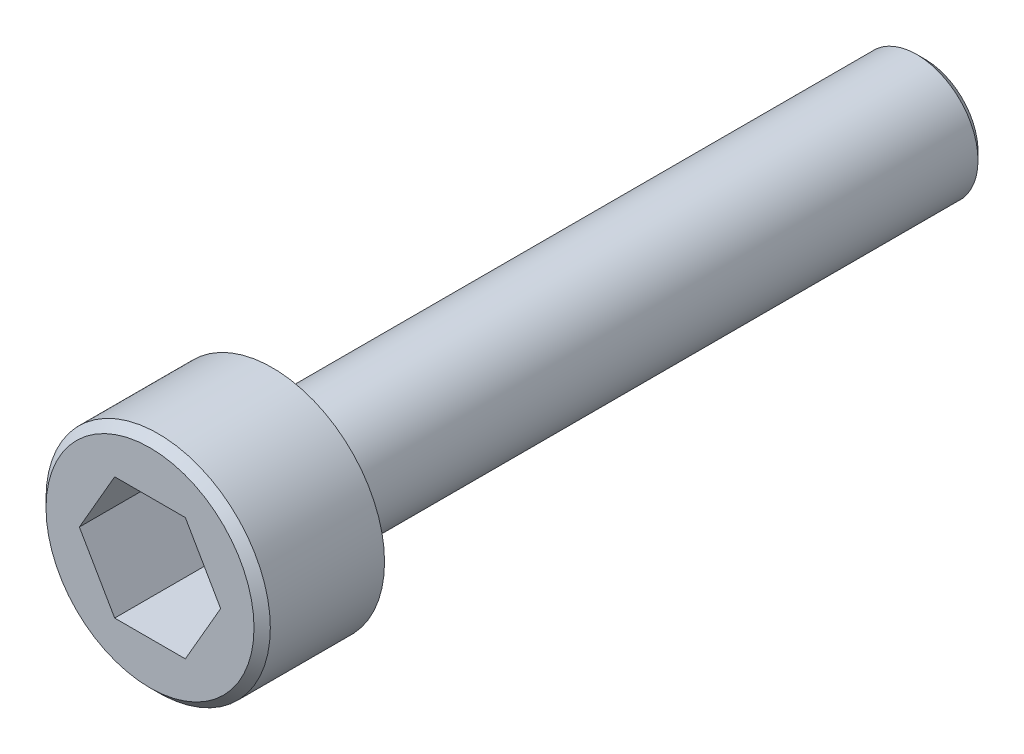
ISO-10303-21;
HEADER;
FILE_DESCRIPTION(('STEP AP214'),'2;1');
FILE_NAME('part.step','',(''),(''),'','','');
FILE_SCHEMA(('AUTOMOTIVE_DESIGN { 1 0 10303 214 1 1 1 1 }'));
ENDSEC;
DATA;
#1=APPLICATION_CONTEXT('core data for automotive mechanical design processes');
#2=APPLICATION_PROTOCOL_DEFINITION('international standard','automotive_design',2000,#1);
#3=PRODUCT_CONTEXT('',#1,'mechanical');
#4=PRODUCT('Part','Part','',(#3));
#5=PRODUCT_RELATED_PRODUCT_CATEGORY('part','',(#4));
#6=PRODUCT_DEFINITION_FORMATION('','',#4);
#7=PRODUCT_DEFINITION_CONTEXT('part definition',#1,'design');
#8=PRODUCT_DEFINITION('design','',#6,#7);
#9=PRODUCT_DEFINITION_SHAPE('','',#8);
#10=(LENGTH_UNIT() NAMED_UNIT(*) SI_UNIT(.MILLI.,.METRE.));
#11=(NAMED_UNIT(*) PLANE_ANGLE_UNIT() SI_UNIT($,.RADIAN.));
#12=(NAMED_UNIT(*) SI_UNIT($,.STERADIAN.) SOLID_ANGLE_UNIT());
#13=UNCERTAINTY_MEASURE_WITH_UNIT(LENGTH_MEASURE(1.E-05),#10,'distance_accuracy_value','');
#14=(GEOMETRIC_REPRESENTATION_CONTEXT(3) GLOBAL_UNCERTAINTY_ASSIGNED_CONTEXT((#13)) GLOBAL_UNIT_ASSIGNED_CONTEXT((#10,
#11,#12)) REPRESENTATION_CONTEXT('',''));
#15=CARTESIAN_POINT('',(0.,0.,0.));
#16=DIRECTION('',(0.,0.,1.));
#17=DIRECTION('',(1.,0.,0.));
#18=AXIS2_PLACEMENT_3D('',#15,#16,#17);
#19=CARTESIAN_POINT('',(-1.5,0.,-19.));
#20=DIRECTION('',(0.,0.,-1.));
#21=DIRECTION('',(-1.,0.,0.));
#22=AXIS2_PLACEMENT_3D('',#19,#20,#21);
#23=PLANE('',#22);
#24=CARTESIAN_POINT('',(0.,0.,-19.));
#25=DIRECTION('',(0.,0.,-1.));
#26=DIRECTION('',(-1.,0.,0.));
#27=AXIS2_PLACEMENT_3D('',#24,#25,#26);
#28=CIRCLE('',#27,1.3);
#29=CARTESIAN_POINT('',(-1.3,0.,-19.));
#30=VERTEX_POINT('',#29);
#31=EDGE_CURVE('E11',#30,#30,#28,.T.);
#32=ORIENTED_EDGE('',*,*,#31,.T.);
#33=EDGE_LOOP('',(#32));
#34=FACE_BOUND('',#33,.T.);
#35=ADVANCED_FACE('F34',(#34),#23,.T.);
#36=CARTESIAN_POINT('',(0.,0.,20.));
#37=DIRECTION('',(0.,0.,1.));
#38=DIRECTION('',(1.,0.,0.));
#39=AXIS2_PLACEMENT_3D('',#36,#37,#38);
#40=CYLINDRICAL_SURFACE('',#39,1.5);
#41=CARTESIAN_POINT('',(0.,0.,-18.8));
#42=DIRECTION('',(0.,0.,-1.));
#43=DIRECTION('',(-1.,0.,0.));
#44=AXIS2_PLACEMENT_3D('',#41,#42,#43);
#45=CIRCLE('',#44,1.5);
#46=CARTESIAN_POINT('',(-1.5,0.,-18.8));
#47=VERTEX_POINT('',#46);
#48=EDGE_CURVE('E42',#47,#47,#45,.F.);
#49=ORIENTED_EDGE('',*,*,#48,.T.);
#50=EDGE_LOOP('',(#49));
#51=FACE_BOUND('',#50,.T.);
#52=CARTESIAN_POINT('',(0.,0.,-3.));
#53=DIRECTION('',(0.,0.,1.));
#54=DIRECTION('',(1.,0.,0.));
#55=AXIS2_PLACEMENT_3D('',#52,#53,#54);
#56=CIRCLE('',#55,1.5);
#57=CARTESIAN_POINT('',(1.5,0.,-3.));
#58=VERTEX_POINT('',#57);
#59=EDGE_CURVE('E208',#58,#58,#56,.T.);
#60=ORIENTED_EDGE('',*,*,#59,.F.);
#61=EDGE_LOOP('',(#60));
#62=FACE_BOUND('',#61,.T.);
#63=ADVANCED_FACE('F188',(#51,#62),#40,.T.);
#64=CARTESIAN_POINT('',(-2.75,0.,-3.));
#65=DIRECTION('',(0.,0.,-1.));
#66=DIRECTION('',(-1.,0.,0.));
#67=AXIS2_PLACEMENT_3D('',#64,#65,#66);
#68=PLANE('',#67);
#69=ORIENTED_EDGE('',*,*,#59,.T.);
#70=EDGE_LOOP('',(#69));
#71=FACE_BOUND('',#70,.T.);
#72=CARTESIAN_POINT('',(0.,0.,-3.));
#73=DIRECTION('',(0.,0.,1.));
#74=DIRECTION('',(1.,0.,0.));
#75=AXIS2_PLACEMENT_3D('',#72,#73,#74);
#76=CIRCLE('',#75,2.75);
#77=CARTESIAN_POINT('',(2.75,0.,-3.));
#78=VERTEX_POINT('',#77);
#79=EDGE_CURVE('E212',#78,#78,#76,.T.);
#80=ORIENTED_EDGE('',*,*,#79,.F.);
#81=EDGE_LOOP('',(#80));
#82=FACE_BOUND('',#81,.T.);
#83=ADVANCED_FACE('F184',(#71,#82),#68,.T.);
#84=CARTESIAN_POINT('',(0.,0.,20.));
#85=DIRECTION('',(0.,0.,1.));
#86=DIRECTION('',(1.,0.,0.));
#87=AXIS2_PLACEMENT_3D('',#84,#85,#86);
#88=CYLINDRICAL_SURFACE('',#87,2.75);
#89=CARTESIAN_POINT('',(0.,0.,-0.200000000000002));
#90=DIRECTION('',(0.,0.,1.));
#91=DIRECTION('',(1.,0.,0.));
#92=AXIS2_PLACEMENT_3D('',#89,#90,#91);
#93=CIRCLE('',#92,2.75);
#94=CARTESIAN_POINT('',(2.75,0.,-0.200000000000002));
#95=VERTEX_POINT('',#94);
#96=EDGE_CURVE('E204',#95,#95,#93,.F.);
#97=ORIENTED_EDGE('',*,*,#96,.T.);
#98=EDGE_LOOP('',(#97));
#99=FACE_BOUND('',#98,.T.);
#100=ORIENTED_EDGE('',*,*,#79,.T.);
#101=EDGE_LOOP('',(#100));
#102=FACE_BOUND('',#101,.T.);
#103=ADVANCED_FACE('F180',(#99,#102),#88,.T.);
#104=CARTESIAN_POINT('',(0.,0.,0.));
#105=DIRECTION('',(0.,0.,1.));
#106=DIRECTION('',(1.,0.,0.));
#107=AXIS2_PLACEMENT_3D('',#104,#105,#106);
#108=PLANE('',#107);
#109=CARTESIAN_POINT('',(0.,0.,0.));
#110=DIRECTION('',(0.,0.,1.));
#111=DIRECTION('',(1.,0.,0.));
#112=AXIS2_PLACEMENT_3D('',#109,#110,#111);
#113=CIRCLE('',#112,2.55);
#114=CARTESIAN_POINT('',(2.55,0.,0.));
#115=VERTEX_POINT('',#114);
#116=EDGE_CURVE('E207',#115,#115,#113,.T.);
#117=ORIENTED_EDGE('',*,*,#116,.T.);
#118=EDGE_LOOP('',(#117));
#119=FACE_BOUND('',#118,.T.);
#120=DIRECTION('',(0.499999999999999,-0.866025403784439,0.));
#121=VECTOR('',#120,1.);
#122=CARTESIAN_POINT('',(-1.73205080756888,0.,0.));
#123=LINE('',#122,#121);
#124=CARTESIAN_POINT('',(-1.73205080756888,0.,0.));
#125=VERTEX_POINT('',#124);
#126=CARTESIAN_POINT('',(-0.866025403784438,-1.5,0.));
#127=VERTEX_POINT('',#126);
#128=EDGE_CURVE('E224',#125,#127,#123,.T.);
#129=ORIENTED_EDGE('',*,*,#128,.F.);
#130=DIRECTION('',(0.5,0.866025403784438,0.));
#131=VECTOR('',#130,1.);
#132=CARTESIAN_POINT('',(-1.73205080756888,0.,0.));
#133=LINE('',#132,#131);
#134=CARTESIAN_POINT('',(-0.866025403784436,1.5,0.));
#135=VERTEX_POINT('',#134);
#136=EDGE_CURVE('E104',#125,#135,#133,.T.);
#137=ORIENTED_EDGE('',*,*,#136,.T.);
#138=DIRECTION('',(1.,0.,0.));
#139=VECTOR('',#138,1.);
#140=CARTESIAN_POINT('',(-0.866025403784436,1.5,0.));
#141=LINE('',#140,#139);
#142=CARTESIAN_POINT('',(0.866025403784436,1.5,0.));
#143=VERTEX_POINT('',#142);
#144=EDGE_CURVE('E244',#135,#143,#141,.T.);
#145=ORIENTED_EDGE('',*,*,#144,.T.);
#146=DIRECTION('',(-0.5,0.866025403784439,0.));
#147=VECTOR('',#146,1.);
#148=CARTESIAN_POINT('',(1.73205080756888,0.,0.));
#149=LINE('',#148,#147);
#150=CARTESIAN_POINT('',(1.73205080756888,0.,0.));
#151=VERTEX_POINT('',#150);
#152=EDGE_CURVE('E241',#151,#143,#149,.T.);
#153=ORIENTED_EDGE('',*,*,#152,.F.);
#154=DIRECTION('',(-0.500000000000001,-0.866025403784438,0.));
#155=VECTOR('',#154,1.);
#156=CARTESIAN_POINT('',(1.73205080756888,0.,0.));
#157=LINE('',#156,#155);
#158=CARTESIAN_POINT('',(0.866025403784437,-1.5,0.));
#159=VERTEX_POINT('',#158);
#160=EDGE_CURVE('E238',#151,#159,#157,.T.);
#161=ORIENTED_EDGE('',*,*,#160,.T.);
#162=DIRECTION('',(1.,0.,0.));
#163=VECTOR('',#162,1.);
#164=CARTESIAN_POINT('',(-0.866025403784438,-1.5,0.));
#165=LINE('',#164,#163);
#166=EDGE_CURVE('E225',#127,#159,#165,.T.);
#167=ORIENTED_EDGE('',*,*,#166,.F.);
#168=EDGE_LOOP('',(#129,#137,#145,#153,#161,#167));
#169=FACE_BOUND('',#168,.T.);
#170=ADVANCED_FACE('F176',(#119,#169),#108,.T.);
#171=CARTESIAN_POINT('',(0.,0.,0.));
#172=DIRECTION('',(0.,0.,-1.));
#173=DIRECTION('',(-1.,0.,0.));
#174=AXIS2_PLACEMENT_3D('',#171,#172,#173);
#175=CONICAL_SURFACE('',#174,2.55,0.785398163397451);
#176=ORIENTED_EDGE('',*,*,#96,.F.);
#177=EDGE_LOOP('',(#176));
#178=FACE_BOUND('',#177,.T.);
#179=ORIENTED_EDGE('',*,*,#116,.F.);
#180=EDGE_LOOP('',(#179));
#181=FACE_BOUND('',#180,.T.);
#182=ADVANCED_FACE('F179',(#178,#181),#175,.T.);
#183=CARTESIAN_POINT('',(0.,0.,-18.8));
#184=DIRECTION('',(0.,0.,1.));
#185=DIRECTION('',(1.,0.,0.));
#186=AXIS2_PLACEMENT_3D('',#183,#184,#185);
#187=CONICAL_SURFACE('',#186,1.5,0.785398163397443);
#188=ORIENTED_EDGE('',*,*,#31,.F.);
#189=EDGE_LOOP('',(#188));
#190=FACE_BOUND('',#189,.T.);
#191=ORIENTED_EDGE('',*,*,#48,.F.);
#192=EDGE_LOOP('',(#191));
#193=FACE_BOUND('',#192,.T.);
#194=ADVANCED_FACE('F36',(#190,#193),#187,.T.);
#195=CARTESIAN_POINT('',(-1.73205080756888,0.,-19.001));
#196=DIRECTION('',(0.866025403784438,-0.5,0.));
#197=DIRECTION('',(0.5,0.866025403784438,0.));
#198=AXIS2_PLACEMENT_3D('',#195,#196,#197);
#199=PLANE('',#198);
#200=DIRECTION('',(0.,0.,1.));
#201=VECTOR('',#200,1.);
#202=CARTESIAN_POINT('',(-0.866025403784436,1.5,-19.001));
#203=LINE('',#202,#201);
#204=CARTESIAN_POINT('',(-0.866025403784436,1.5,-2.4));
#205=VERTEX_POINT('',#204);
#206=EDGE_CURVE('E106',#205,#135,#203,.T.);
#207=ORIENTED_EDGE('',*,*,#206,.T.);
#208=ORIENTED_EDGE('',*,*,#136,.F.);
#209=DIRECTION('',(0.,0.,1.));
#210=VECTOR('',#209,1.);
#211=CARTESIAN_POINT('',(-1.73205080756888,0.,-19.001));
#212=LINE('',#211,#210);
#213=CARTESIAN_POINT('',(-1.73205080756888,0.,-2.4));
#214=VERTEX_POINT('',#213);
#215=EDGE_CURVE('E91',#214,#125,#212,.T.);
#216=ORIENTED_EDGE('',*,*,#215,.F.);
#217=CARTESIAN_POINT('',(-0.865909933730598,1.5002,-2.39993332666711));
#218=CARTESIAN_POINT('',(-0.903968454193443,1.43428070889745,-2.42191714344639));
#219=CARTESIAN_POINT('',(-0.942355490953069,1.36779241087777,-2.44191111053374));
#220=CARTESIAN_POINT('',(-1.01979436916421,1.23366433933493,-2.47681189903106));
#221=CARTESIAN_POINT('',(-1.05884758728358,1.16602218135312,-2.4917063718924));
#222=CARTESIAN_POINT('',(-1.13646999803241,1.03157622213016,-2.51489331890532));
#223=CARTESIAN_POINT('',(-1.17502724286932,0.964793115072755,-2.52334008850375));
#224=CARTESIAN_POINT('',(-1.25232329150576,0.830912431610123,-2.53342642270371));
#225=CARTESIAN_POINT('',(-1.29106181408333,0.763815342295625,-2.53507433685767));
#226=CARTESIAN_POINT('',(-1.363455807133,0.638425268170808,-2.53165837716246));
#227=CARTESIAN_POINT('',(-1.39712207785428,0.580113576780184,-2.52743324099159));
#228=CARTESIAN_POINT('',(-1.46423526865157,0.46387012046122,-2.51403822478289));
#229=CARTESIAN_POINT('',(-1.49768195634505,0.405938758031216,-2.50486376259972));
#230=CARTESIAN_POINT('',(-1.56493368410116,0.289455348660849,-2.48192681626057));
#231=CARTESIAN_POINT('',(-1.59873020609216,0.230918055453309,-2.46806703805412));
#232=CARTESIAN_POINT('',(-1.6658189879754,0.114716876613641,-2.43661021597891));
#233=CARTESIAN_POINT('',(-1.69911210834199,0.0570515005961899,-2.41902057032595));
#234=CARTESIAN_POINT('',(-1.73216627762271,-0.000199999999999791,-2.39993332666711));
#235=B_SPLINE_CURVE_WITH_KNOTS('',3,(#217,#218,#219,#220,#221,#222,#223,#224,#225,#226,#227,
#228,#229,#230,#231,#232,#233,#234),.UNSPECIFIED.,.F.,.F.,(4,2,2,2,2,2,2,2,4),(0.,
0.237777822177382,0.476127422841917,0.708577067230587,0.940741159251576,1.1429435283589,
1.34533342091875,1.55221450553907,1.75868901573748),.UNSPECIFIED.);
#236=EDGE_CURVE('E98',#205,#214,#235,.T.);
#237=ORIENTED_EDGE('',*,*,#236,.F.);
#238=EDGE_LOOP('',(#207,#208,#216,#237));
#239=FACE_BOUND('',#238,.T.);
#240=ADVANCED_FACE('F101',(#239),#199,.T.);
#241=CARTESIAN_POINT('',(-0.866025403784436,1.5,-19.001));
#242=DIRECTION('',(0.,-1.,0.));
#243=DIRECTION('',(0.,0.,-1.));
#244=AXIS2_PLACEMENT_3D('',#241,#242,#243);
#245=PLANE('',#244);
#246=DIRECTION('',(0.,0.,1.));
#247=VECTOR('',#246,1.);
#248=CARTESIAN_POINT('',(0.866025403784436,1.5,-19.001));
#249=LINE('',#248,#247);
#250=CARTESIAN_POINT('',(0.866025403784436,1.5,-2.4));
#251=VERTEX_POINT('',#250);
#252=EDGE_CURVE('E233',#251,#143,#249,.T.);
#253=ORIENTED_EDGE('',*,*,#252,.T.);
#254=ORIENTED_EDGE('',*,*,#144,.F.);
#255=ORIENTED_EDGE('',*,*,#206,.F.);
#256=CARTESIAN_POINT('',(-2.25829748809578,1.5,-1.83476226036428));
#257=CARTESIAN_POINT('',(-2.19329373978807,1.5,-1.86601519216719));
#258=CARTESIAN_POINT('',(-2.128133312472,1.5,-1.89694788984993));
#259=CARTESIAN_POINT('',(-1.99741509731926,1.5,-1.95799129175253));
#260=CARTESIAN_POINT('',(-1.93185724176724,1.5,-1.98810185079199));
#261=CARTESIAN_POINT('',(-1.79988874513808,1.5,-2.04748572809429));
#262=CARTESIAN_POINT('',(-1.73347534797759,1.5,-2.07675294876988));
#263=CARTESIAN_POINT('',(-1.60009663184604,1.5,-2.13399348153228));
#264=CARTESIAN_POINT('',(-1.53313134145763,1.5,-2.16196686013744));
#265=CARTESIAN_POINT('',(-1.39671194439803,1.5,-2.21701546037724));
#266=CARTESIAN_POINT('',(-1.32723952366604,1.5,-2.24404589795094));
#267=CARTESIAN_POINT('',(-1.18747230288705,1.5,-2.29588215834872));
#268=CARTESIAN_POINT('',(-1.11717740111601,1.5,-2.32068770263997));
#269=CARTESIAN_POINT('',(-0.905166704401074,1.5,-2.39073382927791));
#270=CARTESIAN_POINT('',(-0.761941643732071,1.5,-2.4317657243214));
#271=CARTESIAN_POINT('',(-0.544391782620257,1.5,-2.47950620462369));
#272=CARTESIAN_POINT('',(-0.471586349738135,1.5,-2.49310360316395));
#273=CARTESIAN_POINT('',(-0.325142130511555,1.5,-2.51480485629881));
#274=CARTESIAN_POINT('',(-0.251503405528381,1.5,-2.52290911275084));
#275=CARTESIAN_POINT('',(-0.104694150763983,1.5,-2.53287418939744));
#276=CARTESIAN_POINT('',(-0.0315288308890994,1.5,-2.53480979779495));
#277=CARTESIAN_POINT('',(0.114700561049707,1.5,-2.53247388232289));
#278=CARTESIAN_POINT('',(0.187764626951758,1.5,-2.52820199598046));
#279=CARTESIAN_POINT('',(0.367239252204652,1.5,-2.51046042595599));
#280=CARTESIAN_POINT('',(0.473317955749639,1.5,-2.49363148098316));
#281=CARTESIAN_POINT('',(0.683435623347444,1.5,-2.45002097312359));
#282=CARTESIAN_POINT('',(0.787472001216273,1.5,-2.42322755294101));
#283=CARTESIAN_POINT('',(0.94308098733902,1.5,-2.37736239718424));
#284=CARTESIAN_POINT('',(0.995456162128427,1.5,-2.36091222394733));
#285=CARTESIAN_POINT('',(1.09966136197824,1.5,-2.32646559475645));
#286=CARTESIAN_POINT('',(1.15149170317922,1.5,-2.30847009821455));
#287=CARTESIAN_POINT('',(1.25467578293171,1.5,-2.27119644603533));
#288=CARTESIAN_POINT('',(1.30602960082239,1.5,-2.25191850844964));
#289=CARTESIAN_POINT('',(1.40833061218766,1.5,-2.21229102105092));
#290=CARTESIAN_POINT('',(1.45927773605958,1.5,-2.19194129215231));
#291=CARTESIAN_POINT('',(1.59055522154703,1.5,-2.13817109724277));
#292=CARTESIAN_POINT('',(1.67061014066948,1.5,-2.10407883269812));
#293=CARTESIAN_POINT('',(1.82998280172007,1.5,-2.03420800028333));
#294=CARTESIAN_POINT('',(1.90930048451934,1.5,-1.99842929852874));
#295=CARTESIAN_POINT('',(2.14639693381873,1.5,-1.88916412533198));
#296=CARTESIAN_POINT('',(2.30329043971988,1.5,-1.81376068715346));
#297=CARTESIAN_POINT('',(2.61572428743805,1.5,-1.65974435711267));
#298=CARTESIAN_POINT('',(2.77126264489306,1.5,-1.581127488845));
#299=CARTESIAN_POINT('',(3.08126266164183,1.5,-1.42185383584809));
#300=CARTESIAN_POINT('',(3.23572446316291,1.5,-1.34119732735825));
#301=CARTESIAN_POINT('',(3.52907913435708,1.5,-1.18631207108897));
#302=CARTESIAN_POINT('',(3.66803997220469,1.5,-1.1122115998725));
#303=CARTESIAN_POINT('',(3.94551399229581,1.5,-0.963164818284441));
#304=CARTESIAN_POINT('',(4.08402715661448,1.5,-0.888218474570878));
#305=CARTESIAN_POINT('',(4.36034399180415,1.5,-0.737891818107906));
#306=CARTESIAN_POINT('',(4.49814857040257,1.5,-0.662513171610507));
#307=CARTESIAN_POINT('',(4.77347897270567,1.5,-0.511266152172993));
#308=CARTESIAN_POINT('',(4.9110048112979,1.5,-0.43539780634461));
#309=CARTESIAN_POINT('',(5.04843083843807,1.5,-0.35935018291089));
#310=B_SPLINE_CURVE_WITH_KNOTS('',3,(#256,#257,#258,#259,#260,#261,#262,#263,#264,#265,#266,
#267,#268,#269,#270,#271,#272,#273,#274,#275,#276,#277,#278,#279,#280,#281,#282,#283,#284,#285,
#286,#287,#288,#289,#290,#291,#292,#293,#294,#295,#296,#297,#298,#299,#300,#301,#302,#303,#304,
#305,#306,#307,#308,#309),.UNSPECIFIED.,.F.,.F.,(4,2,2,2,2,2,2,2,2,2,2,2,2,2,2,2,2,2,2,2,2,2,2,
2,2,2,4),(0.,0.216382219525618,0.432802405770669,0.65051933644601,0.868225061501739,
1.09182159712903,1.31544608569343,1.76144887147315,1.9834748614657,2.20548460712569,
2.42479227767853,2.64411275473036,2.96566825751222,3.28760762820845,3.45228256222909,
3.61685598713247,3.78140150101924,3.94597459657939,4.20698199748248,4.46801015449814,
4.99015975049455,5.51297628653598,6.03572239000219,6.50816903094607,6.98063435993274,
7.45185338987376,7.92304655125478),.UNSPECIFIED.);
#311=EDGE_CURVE('E112',#251,#205,#310,.F.);
#312=ORIENTED_EDGE('',*,*,#311,.F.);
#313=EDGE_LOOP('',(#253,#254,#255,#312));
#314=FACE_BOUND('',#313,.T.);
#315=ADVANCED_FACE('F161',(#314),#245,.T.);
#316=CARTESIAN_POINT('',(1.73205080756888,0.,-19.001));
#317=DIRECTION('',(0.866025403784439,0.5,0.));
#318=DIRECTION('',(-0.5,0.866025403784439,0.));
#319=AXIS2_PLACEMENT_3D('',#316,#317,#318);
#320=PLANE('',#319);
#321=CARTESIAN_POINT('',(0.865909933730598,1.5002,-2.39993332666712));
#322=CARTESIAN_POINT('',(0.903968454193444,1.43428070889745,-2.42191714344639));
#323=CARTESIAN_POINT('',(0.94235549095307,1.36779241087776,-2.44191111053374));
#324=CARTESIAN_POINT('',(1.01979436916421,1.23366433933493,-2.47681189903106));
#325=CARTESIAN_POINT('',(1.05884758728358,1.16602218135311,-2.4917063718924));
#326=CARTESIAN_POINT('',(1.13646999803241,1.03157622213015,-2.51489331890532));
#327=CARTESIAN_POINT('',(1.17502724286933,0.964793115072749,-2.52334008850375));
#328=CARTESIAN_POINT('',(1.25232329150577,0.830912431610116,-2.53342642270371));
#329=CARTESIAN_POINT('',(1.29106181408333,0.763815342295617,-2.53507433685768));
#330=CARTESIAN_POINT('',(1.363455807133,0.6384252681708,-2.53165837716246));
#331=CARTESIAN_POINT('',(1.39712207785428,0.580113576780176,-2.52743324099159));
#332=CARTESIAN_POINT('',(1.46423526865157,0.463870120461214,-2.5140382247829));
#333=CARTESIAN_POINT('',(1.49768195634505,0.405938758031211,-2.50486376259972));
#334=CARTESIAN_POINT('',(1.56493368410116,0.289455348660845,-2.48192681626057));
#335=CARTESIAN_POINT('',(1.59873020609216,0.230918055453305,-2.46806703805412));
#336=CARTESIAN_POINT('',(1.6658189879754,0.114716876613638,-2.43661021597891));
#337=CARTESIAN_POINT('',(1.69911210834199,0.0570515005961871,-2.41902057032595));
#338=CARTESIAN_POINT('',(1.73216627762271,-0.00020000000000196,-2.39993332666712));
#339=B_SPLINE_CURVE_WITH_KNOTS('',3,(#321,#322,#323,#324,#325,#326,#327,#328,#329,#330,#331,
#332,#333,#334,#335,#336,#337,#338),.UNSPECIFIED.,.F.,.F.,(4,2,2,2,2,2,2,2,4),(0.,
0.237777822177385,0.476127422841921,0.708577067230593,0.940741159251585,1.14294352835891,
1.34533342091876,1.55221450553907,1.75868901573748),.UNSPECIFIED.);
#340=CARTESIAN_POINT('',(1.73205080756888,0.,-2.40000000000001));
#341=VERTEX_POINT('',#340);
#342=EDGE_CURVE('E114',#251,#341,#339,.T.);
#343=ORIENTED_EDGE('',*,*,#342,.T.);
#344=DIRECTION('',(0.,0.,1.));
#345=VECTOR('',#344,1.);
#346=CARTESIAN_POINT('',(1.73205080756888,0.,-19.001));
#347=LINE('',#346,#345);
#348=EDGE_CURVE('E231',#341,#151,#347,.T.);
#349=ORIENTED_EDGE('',*,*,#348,.T.);
#350=ORIENTED_EDGE('',*,*,#152,.T.);
#351=ORIENTED_EDGE('',*,*,#252,.F.);
#352=EDGE_LOOP('',(#343,#349,#350,#351));
#353=FACE_BOUND('',#352,.T.);
#354=ADVANCED_FACE('F158',(#353),#320,.F.);
#355=CARTESIAN_POINT('',(-1.73205080756888,0.,-19.001));
#356=DIRECTION('',(-0.866025403784439,-0.499999999999999,0.));
#357=DIRECTION('',(0.499999999999999,-0.866025403784439,0.));
#358=AXIS2_PLACEMENT_3D('',#355,#356,#357);
#359=PLANE('',#358);
#360=CARTESIAN_POINT('',(-0.865909933730601,-1.5002,-2.39993332666711));
#361=CARTESIAN_POINT('',(-0.903968454193446,-1.43428070889745,-2.42191714344639));
#362=CARTESIAN_POINT('',(-0.942355490953072,-1.36779241087777,-2.44191111053374));
#363=CARTESIAN_POINT('',(-1.01979436916421,-1.23366433933493,-2.47681189903106));
#364=CARTESIAN_POINT('',(-1.05884758728358,-1.16602218135311,-2.4917063718924));
#365=CARTESIAN_POINT('',(-1.13646999803241,-1.03157622213016,-2.51489331890532));
#366=CARTESIAN_POINT('',(-1.17502724286932,-0.964793115072754,-2.52334008850375));
#367=CARTESIAN_POINT('',(-1.25232329150577,-0.830912431610122,-2.53342642270371));
#368=CARTESIAN_POINT('',(-1.29106181408333,-0.763815342295624,-2.53507433685767));
#369=CARTESIAN_POINT('',(-1.363455807133,-0.638425268170807,-2.53165837716246));
#370=CARTESIAN_POINT('',(-1.39712207785428,-0.580113576780183,-2.52743324099159));
#371=CARTESIAN_POINT('',(-1.46423526865157,-0.463870120461219,-2.51403822478289));
#372=CARTESIAN_POINT('',(-1.49768195634505,-0.405938758031216,-2.50486376259972));
#373=CARTESIAN_POINT('',(-1.56493368410116,-0.289455348660849,-2.48192681626057));
#374=CARTESIAN_POINT('',(-1.59873020609216,-0.230918055453309,-2.46806703805412));
#375=CARTESIAN_POINT('',(-1.6658189879754,-0.114716876613641,-2.43661021597891));
#376=CARTESIAN_POINT('',(-1.69911210834199,-0.0570515005961899,-2.41902057032595));
#377=CARTESIAN_POINT('',(-1.73216627762271,0.0001999999999998,-2.39993332666711));
#378=B_SPLINE_CURVE_WITH_KNOTS('',3,(#360,#361,#362,#363,#364,#365,#366,#367,#368,#369,#370,
#371,#372,#373,#374,#375,#376,#377),.UNSPECIFIED.,.F.,.F.,(4,2,2,2,2,2,2,2,4),(0.,
0.237777822177382,0.476127422841917,0.708577067230587,0.940741159251577,1.1429435283589,
1.34533342091875,1.55221450553907,1.75868901573748),.UNSPECIFIED.);
#379=CARTESIAN_POINT('',(-0.866025403784438,-1.5,-2.4));
#380=VERTEX_POINT('',#379);
#381=EDGE_CURVE('E88',#380,#214,#378,.T.);
#382=ORIENTED_EDGE('',*,*,#381,.T.);
#383=ORIENTED_EDGE('',*,*,#215,.T.);
#384=ORIENTED_EDGE('',*,*,#128,.T.);
#385=DIRECTION('',(0.,0.,1.));
#386=VECTOR('',#385,1.);
#387=CARTESIAN_POINT('',(-0.866025403784438,-1.5,-19.001));
#388=LINE('',#387,#386);
#389=EDGE_CURVE('E94',#380,#127,#388,.T.);
#390=ORIENTED_EDGE('',*,*,#389,.F.);
#391=EDGE_LOOP('',(#382,#383,#384,#390));
#392=FACE_BOUND('',#391,.T.);
#393=ADVANCED_FACE('F90',(#392),#359,.F.);
#394=CARTESIAN_POINT('',(1.73205080756888,0.,-19.001));
#395=DIRECTION('',(-0.866025403784438,0.500000000000001,0.));
#396=DIRECTION('',(-0.500000000000001,-0.866025403784438,0.));
#397=AXIS2_PLACEMENT_3D('',#394,#395,#396);
#398=PLANE('',#397);
#399=DIRECTION('',(0.,0.,1.));
#400=VECTOR('',#399,1.);
#401=CARTESIAN_POINT('',(0.866025403784437,-1.5,-19.001));
#402=LINE('',#401,#400);
#403=CARTESIAN_POINT('',(0.866025403784429,-1.50000000000001,-2.4));
#404=VERTEX_POINT('',#403);
#405=EDGE_CURVE('E229',#404,#159,#402,.T.);
#406=ORIENTED_EDGE('',*,*,#405,.T.);
#407=ORIENTED_EDGE('',*,*,#160,.F.);
#408=ORIENTED_EDGE('',*,*,#348,.F.);
#409=CARTESIAN_POINT('',(0.865909933730599,-1.5002,-2.39993332666712));
#410=CARTESIAN_POINT('',(0.903968454193444,-1.43428070889745,-2.42191714344639));
#411=CARTESIAN_POINT('',(0.942355490953071,-1.36779241087776,-2.44191111053374));
#412=CARTESIAN_POINT('',(1.01979436916421,-1.23366433933493,-2.47681189903106));
#413=CARTESIAN_POINT('',(1.05884758728358,-1.16602218135311,-2.4917063718924));
#414=CARTESIAN_POINT('',(1.13646999803241,-1.03157622213015,-2.51489331890532));
#415=CARTESIAN_POINT('',(1.17502724286933,-0.964793115072749,-2.52334008850375));
#416=CARTESIAN_POINT('',(1.25232329150577,-0.830912431610115,-2.53342642270371));
#417=CARTESIAN_POINT('',(1.29106181408333,-0.763815342295617,-2.53507433685767));
#418=CARTESIAN_POINT('',(1.36345580713301,-0.638425268170801,-2.53165837716246));
#419=CARTESIAN_POINT('',(1.39712207785428,-0.580113576780177,-2.52743324099159));
#420=CARTESIAN_POINT('',(1.46423526865157,-0.463870120461215,-2.51403822478289));
#421=CARTESIAN_POINT('',(1.49768195634505,-0.405938758031212,-2.50486376259972));
#422=CARTESIAN_POINT('',(1.56493368410116,-0.289455348660847,-2.48192681626057));
#423=CARTESIAN_POINT('',(1.59873020609216,-0.230918055453308,-2.46806703805412));
#424=CARTESIAN_POINT('',(1.6658189879754,-0.114716876613641,-2.43661021597891));
#425=CARTESIAN_POINT('',(1.69911210834199,-0.057051500596191,-2.41902057032595));
#426=CARTESIAN_POINT('',(1.73216627762271,0.000199999999997863,-2.39993332666712));
#427=B_SPLINE_CURVE_WITH_KNOTS('',3,(#409,#410,#411,#412,#413,#414,#415,#416,#417,#418,#419,
#420,#421,#422,#423,#424,#425,#426),.UNSPECIFIED.,.F.,.F.,(4,2,2,2,2,2,2,2,4),(0.,
0.237777822177385,0.476127422841921,0.708577067230594,0.940741159251585,1.14294352835891,
1.34533342091876,1.55221450553907,1.75868901573748),.UNSPECIFIED.);
#428=EDGE_CURVE('E49',#404,#341,#427,.T.);
#429=ORIENTED_EDGE('',*,*,#428,.F.);
#430=EDGE_LOOP('',(#406,#407,#408,#429));
#431=FACE_BOUND('',#430,.T.);
#432=ADVANCED_FACE('F163',(#431),#398,.T.);
#433=CARTESIAN_POINT('',(-0.866025403784438,-1.5,-19.001));
#434=DIRECTION('',(0.,-1.,0.));
#435=DIRECTION('',(0.,0.,-1.));
#436=AXIS2_PLACEMENT_3D('',#433,#434,#435);
#437=PLANE('',#436);
#438=CARTESIAN_POINT('',(-2.25829748809579,-1.5,-1.83476226036428));
#439=CARTESIAN_POINT('',(-2.19329373978807,-1.5,-1.86601519216719));
#440=CARTESIAN_POINT('',(-2.128133312472,-1.5,-1.89694788984992));
#441=CARTESIAN_POINT('',(-1.99741509731926,-1.5,-1.95799129175253));
#442=CARTESIAN_POINT('',(-1.93185724176724,-1.5,-1.98810185079199));
#443=CARTESIAN_POINT('',(-1.79988874513808,-1.5,-2.04748572809429));
#444=CARTESIAN_POINT('',(-1.73347534797759,-1.5,-2.07675294876987));
#445=CARTESIAN_POINT('',(-1.60009663184604,-1.5,-2.13399348153228));
#446=CARTESIAN_POINT('',(-1.53313134145764,-1.5,-2.16196686013744));
#447=CARTESIAN_POINT('',(-1.39671194439803,-1.5,-2.21701546037724));
#448=CARTESIAN_POINT('',(-1.32723952366604,-1.5,-2.24404589795094));
#449=CARTESIAN_POINT('',(-1.18747230288705,-1.5,-2.29588215834872));
#450=CARTESIAN_POINT('',(-1.11717740111601,-1.5,-2.32068770263997));
#451=CARTESIAN_POINT('',(-0.905166704401076,-1.5,-2.39073382927791));
#452=CARTESIAN_POINT('',(-0.761941643732073,-1.5,-2.4317657243214));
#453=CARTESIAN_POINT('',(-0.544391782620259,-1.5,-2.47950620462369));
#454=CARTESIAN_POINT('',(-0.471586349738137,-1.5,-2.49310360316395));
#455=CARTESIAN_POINT('',(-0.325142130511556,-1.5,-2.51480485629881));
#456=CARTESIAN_POINT('',(-0.251503405528383,-1.5,-2.52290911275084));
#457=CARTESIAN_POINT('',(-0.104694150763985,-1.5,-2.53287418939744));
#458=CARTESIAN_POINT('',(-0.0315288308891013,-1.5,-2.53480979779495));
#459=CARTESIAN_POINT('',(0.114700561049705,-1.5,-2.53247388232289));
#460=CARTESIAN_POINT('',(0.187764626951756,-1.5,-2.52820199598046));
#461=CARTESIAN_POINT('',(0.36723925220465,-1.5,-2.51046042595599));
#462=CARTESIAN_POINT('',(0.473317955749637,-1.5,-2.49363148098316));
#463=CARTESIAN_POINT('',(0.683435623347442,-1.5,-2.45002097312359));
#464=CARTESIAN_POINT('',(0.78747200121627,-1.5,-2.42322755294101));
#465=CARTESIAN_POINT('',(0.943080987339017,-1.5,-2.37736239718424));
#466=CARTESIAN_POINT('',(0.995456162128425,-1.5,-2.36091222394733));
#467=CARTESIAN_POINT('',(1.09966136197824,-1.5,-2.32646559475645));
#468=CARTESIAN_POINT('',(1.15149170317922,-1.5,-2.30847009821455));
#469=CARTESIAN_POINT('',(1.25467578293171,-1.5,-2.27119644603533));
#470=CARTESIAN_POINT('',(1.30602960082239,-1.5,-2.25191850844964));
#471=CARTESIAN_POINT('',(1.40833061218766,-1.5,-2.21229102105092));
#472=CARTESIAN_POINT('',(1.45927773605958,-1.5,-2.19194129215231));
#473=CARTESIAN_POINT('',(1.59055522154702,-1.5,-2.13817109724277));
#474=CARTESIAN_POINT('',(1.67061014066948,-1.5,-2.10407883269812));
#475=CARTESIAN_POINT('',(1.82998280172007,-1.5,-2.03420800028333));
#476=CARTESIAN_POINT('',(1.90930048451934,-1.5,-1.99842929852874));
#477=CARTESIAN_POINT('',(2.14639693381873,-1.5,-1.88916412533198));
#478=CARTESIAN_POINT('',(2.30329043971988,-1.5,-1.81376068715346));
#479=CARTESIAN_POINT('',(2.61572428743805,-1.5,-1.65974435711267));
#480=CARTESIAN_POINT('',(2.77126264489306,-1.5,-1.581127488845));
#481=CARTESIAN_POINT('',(3.08126266164183,-1.5,-1.42185383584809));
#482=CARTESIAN_POINT('',(3.23572446316291,-1.5,-1.34119732735825));
#483=CARTESIAN_POINT('',(3.52907913435708,-1.5,-1.18631207108897));
#484=CARTESIAN_POINT('',(3.66803997220469,-1.5,-1.1122115998725));
#485=CARTESIAN_POINT('',(3.94551399229581,-1.5,-0.96316481828444));
#486=CARTESIAN_POINT('',(4.08402715661449,-1.5,-0.888218474570877));
#487=CARTESIAN_POINT('',(4.36034399180416,-1.5,-0.737891818107905));
#488=CARTESIAN_POINT('',(4.49814857040257,-1.5,-0.662513171610506));
#489=CARTESIAN_POINT('',(4.77347897270568,-1.5,-0.511266152172992));
#490=CARTESIAN_POINT('',(4.91100481129791,-1.5,-0.435397806344608));
#491=CARTESIAN_POINT('',(5.04843083843807,-1.5,-0.359350182910888));
#492=B_SPLINE_CURVE_WITH_KNOTS('',3,(#438,#439,#440,#441,#442,#443,#444,#445,#446,#447,#448,
#449,#450,#451,#452,#453,#454,#455,#456,#457,#458,#459,#460,#461,#462,#463,#464,#465,#466,#467,
#468,#469,#470,#471,#472,#473,#474,#475,#476,#477,#478,#479,#480,#481,#482,#483,#484,#485,#486,
#487,#488,#489,#490,#491),.UNSPECIFIED.,.F.,.F.,(4,2,2,2,2,2,2,2,2,2,2,2,2,2,2,2,2,2,2,2,2,2,2,
2,2,2,4),(0.,0.216382219525618,0.43280240577067,0.650519336446011,0.868225061501739,
1.09182159712903,1.31544608569343,1.76144887147315,1.9834748614657,2.20548460712569,
2.42479227767853,2.64411275473036,2.96566825751222,3.28760762820845,3.45228256222909,
3.61685598713247,3.78140150101924,3.94597459657939,4.20698199748248,4.46801015449814,
4.99015975049455,5.51297628653598,6.03572239000219,6.50816903094607,6.98063435993275,
7.45185338987377,7.92304655125479),.UNSPECIFIED.);
#493=EDGE_CURVE('E107',#404,#380,#492,.F.);
#494=ORIENTED_EDGE('',*,*,#493,.T.);
#495=ORIENTED_EDGE('',*,*,#389,.T.);
#496=ORIENTED_EDGE('',*,*,#166,.T.);
#497=ORIENTED_EDGE('',*,*,#405,.F.);
#498=EDGE_LOOP('',(#494,#495,#496,#497));
#499=FACE_BOUND('',#498,.T.);
#500=ADVANCED_FACE('F167',(#499),#437,.F.);
#501=CARTESIAN_POINT('',(0.,0.,-2.34226497308105));
#502=DIRECTION('',(0.,0.,1.));
#503=DIRECTION('',(1.,0.,0.));
#504=AXIS2_PLACEMENT_3D('',#501,#502,#503);
#505=CONICAL_SURFACE('',#504,1.83205080756886,1.04719755119659);
#506=ORIENTED_EDGE('',*,*,#236,.T.);
#507=ORIENTED_EDGE('',*,*,#381,.F.);
#508=ORIENTED_EDGE('',*,*,#493,.F.);
#509=ORIENTED_EDGE('',*,*,#428,.T.);
#510=ORIENTED_EDGE('',*,*,#342,.F.);
#511=ORIENTED_EDGE('',*,*,#311,.T.);
#512=EDGE_LOOP('',(#506,#507,#508,#509,#510,#511));
#513=FACE_BOUND('',#512,.T.);
#514=CARTESIAN_POINT('',(0.,0.,-3.39999999999999));
#515=VERTEX_POINT('',#514);
#516=VERTEX_LOOP('',#515);
#517=FACE_BOUND('',#516,.T.);
#518=ADVANCED_FACE('F110',(#513,#517),#505,.F.);
#519=CLOSED_SHELL('',(#35,#63,#83,#103,#170,#182,#194,#240,#315,#354,#393,#432,#500,#518));
#520=MANIFOLD_SOLID_BREP('B2',#519);
#521=ADVANCED_BREP_SHAPE_REPRESENTATION('',(#18,#520),#14);
#522=SHAPE_DEFINITION_REPRESENTATION(#9,#521);
ENDSEC;
END-ISO-10303-21;
